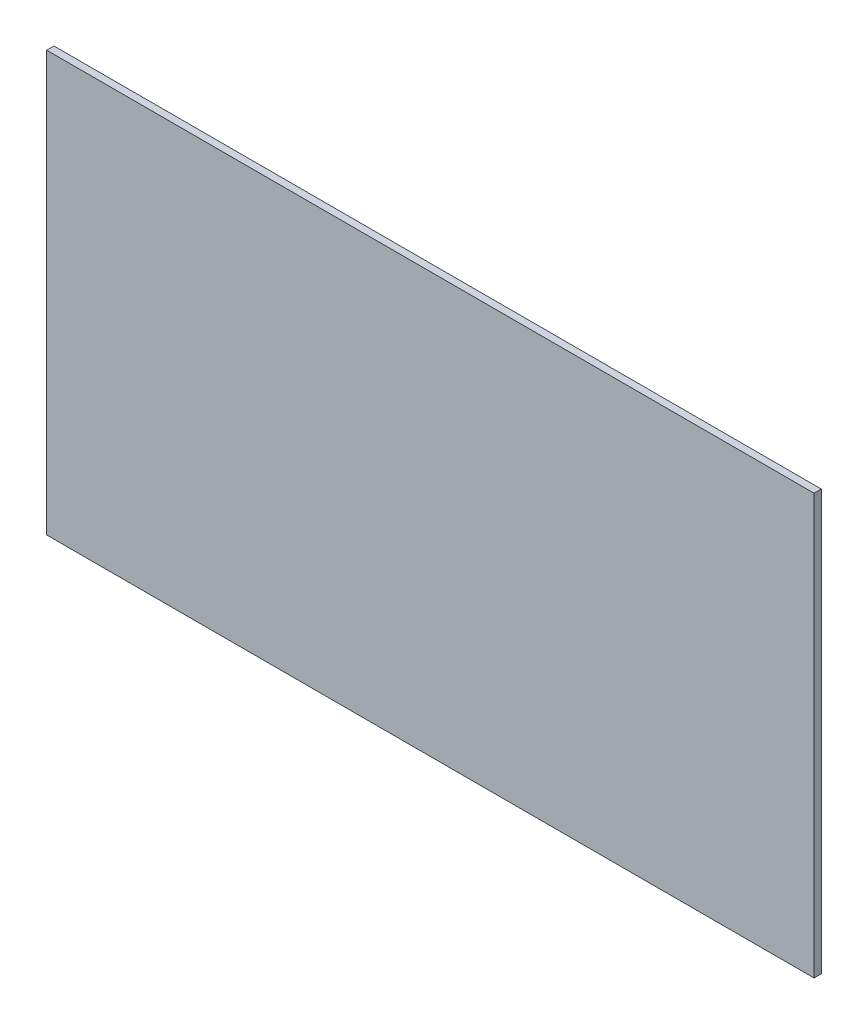
ISO-10303-21;
HEADER;
FILE_DESCRIPTION(('STEP AP214'),'2;1');
FILE_NAME('part.step','',(''),(''),'','','');
FILE_SCHEMA(('AUTOMOTIVE_DESIGN { 1 0 10303 214 1 1 1 1 }'));
ENDSEC;
DATA;
#1=APPLICATION_CONTEXT('core data for automotive mechanical design processes');
#2=APPLICATION_PROTOCOL_DEFINITION('international standard','automotive_design',2000,#1);
#3=PRODUCT_CONTEXT('',#1,'mechanical');
#4=PRODUCT('Part','Part','',(#3));
#5=PRODUCT_RELATED_PRODUCT_CATEGORY('part','',(#4));
#6=PRODUCT_DEFINITION_FORMATION('','',#4);
#7=PRODUCT_DEFINITION_CONTEXT('part definition',#1,'design');
#8=PRODUCT_DEFINITION('design','',#6,#7);
#9=PRODUCT_DEFINITION_SHAPE('','',#8);
#10=(LENGTH_UNIT() NAMED_UNIT(*) SI_UNIT(.MILLI.,.METRE.));
#11=(NAMED_UNIT(*) PLANE_ANGLE_UNIT() SI_UNIT($,.RADIAN.));
#12=(NAMED_UNIT(*) SI_UNIT($,.STERADIAN.) SOLID_ANGLE_UNIT());
#13=UNCERTAINTY_MEASURE_WITH_UNIT(LENGTH_MEASURE(1.E-05),#10,'distance_accuracy_value','');
#14=(GEOMETRIC_REPRESENTATION_CONTEXT(3) GLOBAL_UNCERTAINTY_ASSIGNED_CONTEXT((#13)) GLOBAL_UNIT_ASSIGNED_CONTEXT((#10,
#11,#12)) REPRESENTATION_CONTEXT('',''));
#15=CARTESIAN_POINT('',(0.,0.,0.));
#16=DIRECTION('',(0.,0.,1.));
#17=DIRECTION('',(1.,0.,0.));
#18=AXIS2_PLACEMENT_3D('',#15,#16,#17);
#19=CARTESIAN_POINT('',(0.,0.,0.));
#20=DIRECTION('',(0.,0.,0.999999999999982));
#21=DIRECTION('',(0.999999999999982,0.,0.));
#22=AXIS2_PLACEMENT_3D('',#19,#20,#21);
#23=PLANE('',#22);
#24=DIRECTION('',(0.999999999999982,0.,0.));
#25=VECTOR('',#24,1.);
#26=CARTESIAN_POINT('',(76.8806814643277,114.961869700864,-1.71737624121704E-13));
#27=LINE('',#26,#25);
#28=CARTESIAN_POINT('',(66.7206814643277,114.961869700864,-1.56125112837913E-13));
#29=VERTEX_POINT('',#28);
#30=CARTESIAN_POINT('',(76.8806814643277,114.961869700864,-1.71737624121704E-13));
#31=VERTEX_POINT('',#30);
#32=EDGE_CURVE('E209',#29,#31,#27,.T.);
#33=ORIENTED_EDGE('',*,*,#32,.T.);
#34=DIRECTION('',(0.,-0.999999999999982,0.));
#35=VECTOR('',#34,1.);
#36=CARTESIAN_POINT('',(76.8806814643276,114.199869700864,-1.66533453693773E-13));
#37=LINE('',#36,#35);
#38=CARTESIAN_POINT('',(76.8806814643276,114.199869700864,-1.66533453693773E-13));
#39=VERTEX_POINT('',#38);
#40=EDGE_CURVE('E13',#31,#39,#37,.T.);
#41=ORIENTED_EDGE('',*,*,#40,.T.);
#42=DIRECTION('',(-0.999999999999982,0.,0.));
#43=VECTOR('',#42,1.);
#44=CARTESIAN_POINT('',(76.8806814643276,114.199869700864,-1.66533453693773E-13));
#45=LINE('',#44,#43);
#46=CARTESIAN_POINT('',(66.7206814643276,114.199869700864,-1.76941794549634E-13));
#47=VERTEX_POINT('',#46);
#48=EDGE_CURVE('E273',#39,#47,#45,.T.);
#49=ORIENTED_EDGE('',*,*,#48,.T.);
#50=DIRECTION('',(0.,0.999999999999982,0.));
#51=VECTOR('',#50,1.);
#52=CARTESIAN_POINT('',(66.7206814643276,114.199869700864,-1.76941794549634E-13));
#53=LINE('',#52,#51);
#54=EDGE_CURVE('E277',#47,#29,#53,.T.);
#55=ORIENTED_EDGE('',*,*,#54,.T.);
#56=EDGE_LOOP('',(#33,#41,#49,#55));
#57=FACE_BOUND('',#56,.T.);
#58=ADVANCED_FACE('F200',(#57),#23,.F.);
#59=CARTESIAN_POINT('',(78.5316814643278,110.897869700864,0.126999999999816));
#60=DIRECTION('',(-0.999999999999982,0.,0.));
#61=DIRECTION('',(0.,-0.999999999999982,0.));
#62=AXIS2_PLACEMENT_3D('',#59,#60,#61);
#63=PLANE('',#62);
#64=DIRECTION('',(0.,0.999999999999982,0.));
#65=VECTOR('',#64,1.);
#66=CARTESIAN_POINT('',(78.5316814643278,110.897869700864,-1.71737624121704E-13));
#67=LINE('',#66,#65);
#68=CARTESIAN_POINT('',(78.5316814643278,110.897869700864,-1.71737624121704E-13));
#69=VERTEX_POINT('',#68);
#70=CARTESIAN_POINT('',(78.5316814643273,118.263869700864,-1.56125112837913E-13));
#71=VERTEX_POINT('',#70);
#72=EDGE_CURVE('E272',#69,#71,#67,.T.);
#73=ORIENTED_EDGE('',*,*,#72,.T.);
#74=DIRECTION('',(0.,0.,-0.999999999999982));
#75=VECTOR('',#74,1.);
#76=CARTESIAN_POINT('',(78.5316814643273,118.263869700864,0.12699999999986));
#77=LINE('',#76,#75);
#78=CARTESIAN_POINT('',(78.5316814643273,118.263869700864,0.12699999999986));
#79=VERTEX_POINT('',#78);
#80=EDGE_CURVE('E253',#79,#71,#77,.T.);
#81=ORIENTED_EDGE('',*,*,#80,.F.);
#82=DIRECTION('',(0.,0.999999999999982,0.));
#83=VECTOR('',#82,1.);
#84=CARTESIAN_POINT('',(78.5316814643278,110.897869700864,0.126999999999816));
#85=LINE('',#84,#83);
#86=CARTESIAN_POINT('',(78.5316814643278,110.897869700864,0.126999999999816));
#87=VERTEX_POINT('',#86);
#88=EDGE_CURVE('E260',#87,#79,#85,.T.);
#89=ORIENTED_EDGE('',*,*,#88,.F.);
#90=DIRECTION('',(0.,0.,-0.999999999999982));
#91=VECTOR('',#90,1.);
#92=CARTESIAN_POINT('',(78.5316814643278,110.897869700864,0.126999999999816));
#93=LINE('',#92,#91);
#94=EDGE_CURVE('E303',#87,#69,#93,.T.);
#95=ORIENTED_EDGE('',*,*,#94,.T.);
#96=EDGE_LOOP('',(#73,#81,#89,#95));
#97=FACE_BOUND('',#96,.T.);
#98=ADVANCED_FACE('F202',(#97),#63,.F.);
#99=CARTESIAN_POINT('',(78.5316814643273,118.263869700864,0.12699999999986));
#100=DIRECTION('',(0.,-0.999999999999982,0.));
#101=DIRECTION('',(0.999999999999982,0.,0.));
#102=AXIS2_PLACEMENT_3D('',#99,#100,#101);
#103=PLANE('',#102);
#104=DIRECTION('',(-0.999999999999982,0.,0.));
#105=VECTOR('',#104,1.);
#106=CARTESIAN_POINT('',(78.5316814643273,118.263869700864,-1.56125112837913E-13));
#107=LINE('',#106,#105);
#108=CARTESIAN_POINT('',(65.0696814643277,118.263869700863,-1.56125112837913E-13));
#109=VERTEX_POINT('',#108);
#110=EDGE_CURVE('E294',#71,#109,#107,.T.);
#111=ORIENTED_EDGE('',*,*,#110,.T.);
#112=DIRECTION('',(0.,0.,-0.999999999999982));
#113=VECTOR('',#112,1.);
#114=CARTESIAN_POINT('',(65.0696814643277,118.263869700863,0.12699999999986));
#115=LINE('',#114,#113);
#116=CARTESIAN_POINT('',(65.0696814643277,118.263869700863,0.12699999999986));
#117=VERTEX_POINT('',#116);
#118=EDGE_CURVE('E256',#117,#109,#115,.T.);
#119=ORIENTED_EDGE('',*,*,#118,.F.);
#120=DIRECTION('',(-0.999999999999982,0.,0.));
#121=VECTOR('',#120,1.);
#122=CARTESIAN_POINT('',(78.5316814643273,118.263869700864,0.12699999999986));
#123=LINE('',#122,#121);
#124=EDGE_CURVE('E249',#79,#117,#123,.T.);
#125=ORIENTED_EDGE('',*,*,#124,.F.);
#126=ORIENTED_EDGE('',*,*,#80,.T.);
#127=EDGE_LOOP('',(#111,#119,#125,#126));
#128=FACE_BOUND('',#127,.T.);
#129=ADVANCED_FACE('F251',(#128),#103,.F.);
#130=CARTESIAN_POINT('',(65.0696814643277,118.263869700863,0.12699999999986));
#131=DIRECTION('',(0.999999999999982,0.,0.));
#132=DIRECTION('',(0.,0.999999999999982,0.));
#133=AXIS2_PLACEMENT_3D('',#130,#131,#132);
#134=PLANE('',#133);
#135=DIRECTION('',(0.,-0.999999999999982,0.));
#136=VECTOR('',#135,1.);
#137=CARTESIAN_POINT('',(65.0696814643277,118.263869700863,-1.56125112837913E-13));
#138=LINE('',#137,#136);
#139=CARTESIAN_POINT('',(65.0696814643291,110.897869700864,-1.71737624121704E-13));
#140=VERTEX_POINT('',#139);
#141=EDGE_CURVE('E296',#109,#140,#138,.T.);
#142=ORIENTED_EDGE('',*,*,#141,.T.);
#143=DIRECTION('',(0.,0.,-0.999999999999982));
#144=VECTOR('',#143,1.);
#145=CARTESIAN_POINT('',(65.0696814643291,110.897869700864,0.126999999999816));
#146=LINE('',#145,#144);
#147=CARTESIAN_POINT('',(65.0696814643291,110.897869700864,0.126999999999816));
#148=VERTEX_POINT('',#147);
#149=EDGE_CURVE('E279',#148,#140,#146,.T.);
#150=ORIENTED_EDGE('',*,*,#149,.F.);
#151=DIRECTION('',(0.,-0.999999999999982,0.));
#152=VECTOR('',#151,1.);
#153=CARTESIAN_POINT('',(65.0696814643277,118.263869700863,0.12699999999986));
#154=LINE('',#153,#152);
#155=EDGE_CURVE('E259',#117,#148,#154,.T.);
#156=ORIENTED_EDGE('',*,*,#155,.F.);
#157=ORIENTED_EDGE('',*,*,#118,.T.);
#158=EDGE_LOOP('',(#142,#150,#156,#157));
#159=FACE_BOUND('',#158,.T.);
#160=ADVANCED_FACE('F309',(#159),#134,.F.);
#161=CARTESIAN_POINT('',(65.0696814643291,110.897869700864,0.126999999999816));
#162=DIRECTION('',(0.,0.999999999999982,0.));
#163=DIRECTION('',(-0.999999999999982,0.,0.));
#164=AXIS2_PLACEMENT_3D('',#161,#162,#163);
#165=PLANE('',#164);
#166=DIRECTION('',(0.999999999999982,0.,0.));
#167=VECTOR('',#166,1.);
#168=CARTESIAN_POINT('',(65.0696814643291,110.897869700864,-1.71737624121704E-13));
#169=LINE('',#168,#167);
#170=EDGE_CURVE('E269',#140,#69,#169,.T.);
#171=ORIENTED_EDGE('',*,*,#170,.T.);
#172=ORIENTED_EDGE('',*,*,#94,.F.);
#173=DIRECTION('',(0.999999999999982,0.,0.));
#174=VECTOR('',#173,1.);
#175=CARTESIAN_POINT('',(65.0696814643291,110.897869700864,0.126999999999816));
#176=LINE('',#175,#174);
#177=EDGE_CURVE('E265',#148,#87,#176,.T.);
#178=ORIENTED_EDGE('',*,*,#177,.F.);
#179=ORIENTED_EDGE('',*,*,#149,.T.);
#180=EDGE_LOOP('',(#171,#172,#178,#179));
#181=FACE_BOUND('',#180,.T.);
#182=ADVANCED_FACE('F307',(#181),#165,.F.);
#183=CARTESIAN_POINT('',(0.,0.,0.126999999999988));
#184=DIRECTION('',(0.,0.,0.999999999999982));
#185=DIRECTION('',(0.999999999999982,0.,0.));
#186=AXIS2_PLACEMENT_3D('',#183,#184,#185);
#187=PLANE('',#186);
#188=ORIENTED_EDGE('',*,*,#88,.T.);
#189=ORIENTED_EDGE('',*,*,#124,.T.);
#190=ORIENTED_EDGE('',*,*,#155,.T.);
#191=ORIENTED_EDGE('',*,*,#177,.T.);
#192=EDGE_LOOP('',(#188,#189,#190,#191));
#193=FACE_BOUND('',#192,.T.);
#194=ADVANCED_FACE('F263',(#193),#187,.T.);
#195=ORIENTED_EDGE('',*,*,#40,.F.);
#196=ORIENTED_EDGE('',*,*,#32,.F.);
#197=ORIENTED_EDGE('',*,*,#54,.F.);
#198=ORIENTED_EDGE('',*,*,#48,.F.);
#199=EDGE_LOOP('',(#195,#196,#197,#198));
#200=FACE_BOUND('',#199,.T.);
#201=ORIENTED_EDGE('',*,*,#72,.F.);
#202=ORIENTED_EDGE('',*,*,#170,.F.);
#203=ORIENTED_EDGE('',*,*,#141,.F.);
#204=ORIENTED_EDGE('',*,*,#110,.F.);
#205=EDGE_LOOP('',(#201,#202,#203,#204));
#206=FACE_BOUND('',#205,.T.);
#207=ADVANCED_FACE('F288',(#200,#206),#23,.F.);
#208=CLOSED_SHELL('',(#58,#98,#129,#160,#182,#194,#207));
#209=MANIFOLD_SOLID_BREP('B2',#208);
#210=ADVANCED_BREP_SHAPE_REPRESENTATION('',(#18,#209),#14);
#211=SHAPE_DEFINITION_REPRESENTATION(#9,#210);
ENDSEC;
END-ISO-10303-21;
